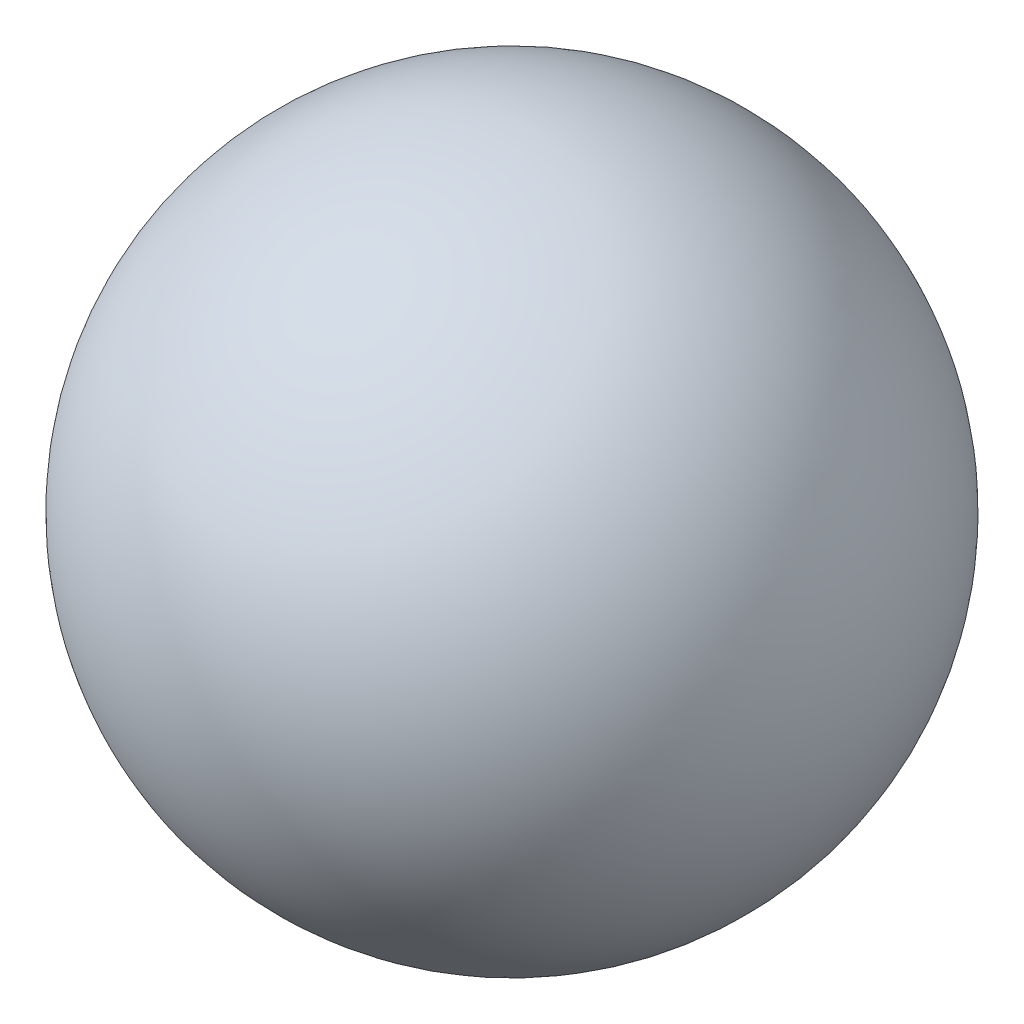
ISO-10303-21;
HEADER;
FILE_DESCRIPTION(('STEP AP214'),'2;1');
FILE_NAME('part.step','',(''),(''),'','','');
FILE_SCHEMA(('AUTOMOTIVE_DESIGN { 1 0 10303 214 1 1 1 1 }'));
ENDSEC;
DATA;
#1=APPLICATION_CONTEXT('core data for automotive mechanical design processes');
#2=APPLICATION_PROTOCOL_DEFINITION('international standard','automotive_design',2000,#1);
#3=PRODUCT_CONTEXT('',#1,'mechanical');
#4=PRODUCT('Part','Part','',(#3));
#5=PRODUCT_RELATED_PRODUCT_CATEGORY('part','',(#4));
#6=PRODUCT_DEFINITION_FORMATION('','',#4);
#7=PRODUCT_DEFINITION_CONTEXT('part definition',#1,'design');
#8=PRODUCT_DEFINITION('design','',#6,#7);
#9=PRODUCT_DEFINITION_SHAPE('','',#8);
#10=(LENGTH_UNIT() NAMED_UNIT(*) SI_UNIT(.MILLI.,.METRE.));
#11=(NAMED_UNIT(*) PLANE_ANGLE_UNIT() SI_UNIT($,.RADIAN.));
#12=(NAMED_UNIT(*) SI_UNIT($,.STERADIAN.) SOLID_ANGLE_UNIT());
#13=UNCERTAINTY_MEASURE_WITH_UNIT(LENGTH_MEASURE(1.E-05),#10,'distance_accuracy_value','');
#14=(GEOMETRIC_REPRESENTATION_CONTEXT(3) GLOBAL_UNCERTAINTY_ASSIGNED_CONTEXT((#13)) GLOBAL_UNIT_ASSIGNED_CONTEXT((#10,
#11,#12)) REPRESENTATION_CONTEXT('',''));
#15=CARTESIAN_POINT('',(0.,0.,0.));
#16=DIRECTION('',(0.,0.,1.));
#17=DIRECTION('',(1.,0.,0.));
#18=AXIS2_PLACEMENT_3D('',#15,#16,#17);
#19=CARTESIAN_POINT('',(0.,0.,0.));
#20=DIRECTION('',(0.,0.,-1.));
#21=DIRECTION('',(1.,0.,0.));
#22=AXIS2_PLACEMENT_3D('',#19,#20,#21);
#23=SPHERICAL_SURFACE('',#22,44.4428678788082);
#24=CARTESIAN_POINT('',(0.,0.,-44.4428678788082));
#25=VERTEX_POINT('',#24);
#26=VERTEX_LOOP('',#25);
#27=FACE_BOUND('',#26,.T.);
#28=ADVANCED_FACE('F32',(#27),#23,.T.);
#29=CLOSED_SHELL('',(#28));
#30=MANIFOLD_SOLID_BREP('B2',#29);
#31=ADVANCED_BREP_SHAPE_REPRESENTATION('',(#18,#30),#14);
#32=SHAPE_DEFINITION_REPRESENTATION(#9,#31);
ENDSEC;
END-ISO-10303-21;
